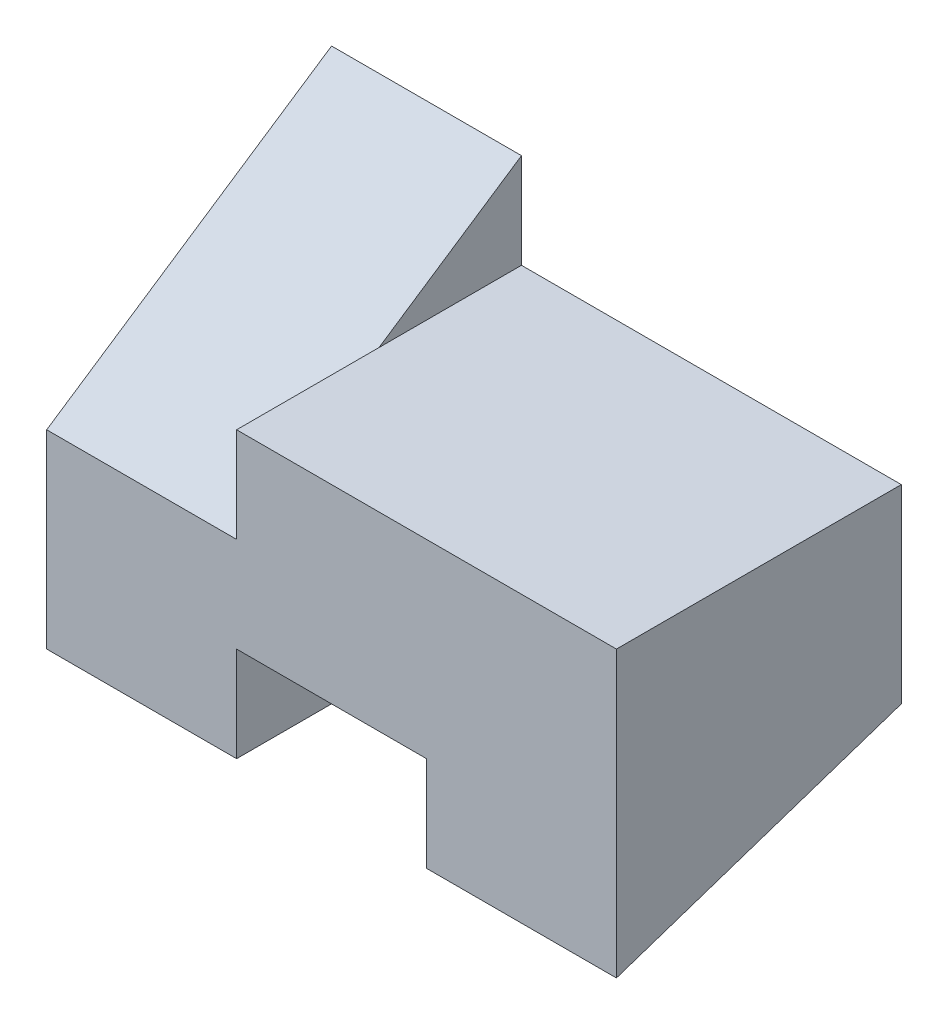
ISO-10303-21;
HEADER;
FILE_DESCRIPTION(('STEP AP214'),'2;1');
FILE_NAME('part.step','',(''),(''),'','','');
FILE_SCHEMA(('AUTOMOTIVE_DESIGN { 1 0 10303 214 1 1 1 1 }'));
ENDSEC;
DATA;
#1=APPLICATION_CONTEXT('core data for automotive mechanical design processes');
#2=APPLICATION_PROTOCOL_DEFINITION('international standard','automotive_design',2000,#1);
#3=PRODUCT_CONTEXT('',#1,'mechanical');
#4=PRODUCT('Part','Part','',(#3));
#5=PRODUCT_RELATED_PRODUCT_CATEGORY('part','',(#4));
#6=PRODUCT_DEFINITION_FORMATION('','',#4);
#7=PRODUCT_DEFINITION_CONTEXT('part definition',#1,'design');
#8=PRODUCT_DEFINITION('design','',#6,#7);
#9=PRODUCT_DEFINITION_SHAPE('','',#8);
#10=(LENGTH_UNIT() NAMED_UNIT(*) SI_UNIT(.MILLI.,.METRE.));
#11=(NAMED_UNIT(*) PLANE_ANGLE_UNIT() SI_UNIT($,.RADIAN.));
#12=(NAMED_UNIT(*) SI_UNIT($,.STERADIAN.) SOLID_ANGLE_UNIT());
#13=UNCERTAINTY_MEASURE_WITH_UNIT(LENGTH_MEASURE(1.E-05),#10,'distance_accuracy_value','');
#14=(GEOMETRIC_REPRESENTATION_CONTEXT(3) GLOBAL_UNCERTAINTY_ASSIGNED_CONTEXT((#13)) GLOBAL_UNIT_ASSIGNED_CONTEXT((#10,
#11,#12)) REPRESENTATION_CONTEXT('',''));
#15=CARTESIAN_POINT('',(0.,0.,0.));
#16=DIRECTION('',(0.,0.,1.));
#17=DIRECTION('',(1.,0.,0.));
#18=AXIS2_PLACEMENT_3D('',#15,#16,#17);
#19=CARTESIAN_POINT('',(-10.,5.,15.));
#20=DIRECTION('',(1.,0.,0.));
#21=DIRECTION('',(0.,1.,0.));
#22=AXIS2_PLACEMENT_3D('',#19,#20,#21);
#23=PLANE('',#22);
#24=DIRECTION('',(0.,0.554700196225229,-0.832050294337844));
#25=VECTOR('',#24,1.);
#26=CARTESIAN_POINT('',(-10.,15.,0.));
#27=LINE('',#26,#25);
#28=CARTESIAN_POINT('',(-10.,5.,15.));
#29=VERTEX_POINT('',#28);
#30=CARTESIAN_POINT('',(-10.,10.,7.5));
#31=VERTEX_POINT('',#30);
#32=EDGE_CURVE('E97',#29,#31,#27,.T.);
#33=ORIENTED_EDGE('',*,*,#32,.F.);
#34=DIRECTION('',(0.,-1.,0.));
#35=VECTOR('',#34,1.);
#36=CARTESIAN_POINT('',(-10.,5.,15.));
#37=LINE('',#36,#35);
#38=CARTESIAN_POINT('',(-10.,10.,15.));
#39=VERTEX_POINT('',#38);
#40=EDGE_CURVE('E99',#39,#29,#37,.T.);
#41=ORIENTED_EDGE('',*,*,#40,.F.);
#42=DIRECTION('',(0.,0.,-1.));
#43=VECTOR('',#42,1.);
#44=CARTESIAN_POINT('',(-10.,10.,15.));
#45=LINE('',#44,#43);
#46=EDGE_CURVE('E100',#39,#31,#45,.T.);
#47=ORIENTED_EDGE('',*,*,#46,.T.);
#48=EDGE_LOOP('',(#33,#41,#47));
#49=FACE_BOUND('',#48,.T.);
#50=ADVANCED_FACE('F33',(#49),#23,.F.);
#51=CARTESIAN_POINT('',(-10.,0.,15.));
#52=DIRECTION('',(-1.,0.,0.));
#53=DIRECTION('',(0.,0.,1.));
#54=AXIS2_PLACEMENT_3D('',#51,#52,#53);
#55=PLANE('',#54);
#56=DIRECTION('',(0.,-0.316227766016838,-0.948683298050514));
#57=VECTOR('',#56,1.);
#58=CARTESIAN_POINT('',(-10.,0.,15.));
#59=LINE('',#58,#57);
#60=CARTESIAN_POINT('',(-10.,0.,15.));
#61=VERTEX_POINT('',#60);
#62=CARTESIAN_POINT('',(-10.,-5.,0.));
#63=VERTEX_POINT('',#62);
#64=EDGE_CURVE('E145',#61,#63,#59,.T.);
#65=ORIENTED_EDGE('',*,*,#64,.F.);
#66=DIRECTION('',(0.,1.,0.));
#67=VECTOR('',#66,1.);
#68=CARTESIAN_POINT('',(-10.,0.,15.));
#69=LINE('',#68,#67);
#70=CARTESIAN_POINT('',(-10.,-5.,15.));
#71=VERTEX_POINT('',#70);
#72=EDGE_CURVE('E82',#71,#61,#69,.T.);
#73=ORIENTED_EDGE('',*,*,#72,.F.);
#74=DIRECTION('',(0.,0.,-1.));
#75=VECTOR('',#74,1.);
#76=CARTESIAN_POINT('',(-10.,-5.,15.));
#77=LINE('',#76,#75);
#78=EDGE_CURVE('E41',#71,#63,#77,.T.);
#79=ORIENTED_EDGE('',*,*,#78,.T.);
#80=EDGE_LOOP('',(#65,#73,#79));
#81=FACE_BOUND('',#80,.T.);
#82=ADVANCED_FACE('F247',(#81),#55,.F.);
#83=CARTESIAN_POINT('',(-10.,-5.,15.));
#84=DIRECTION('',(0.,1.,0.));
#85=DIRECTION('',(0.,0.,1.));
#86=AXIS2_PLACEMENT_3D('',#83,#84,#85);
#87=PLANE('',#86);
#88=DIRECTION('',(1.,0.,0.));
#89=VECTOR('',#88,1.);
#90=CARTESIAN_POINT('',(-10.,-5.,0.));
#91=LINE('',#90,#89);
#92=CARTESIAN_POINT('',(-20.,-5.,0.));
#93=VERTEX_POINT('',#92);
#94=EDGE_CURVE('E123',#93,#63,#91,.T.);
#95=ORIENTED_EDGE('',*,*,#94,.T.);
#96=ORIENTED_EDGE('',*,*,#78,.F.);
#97=DIRECTION('',(1.,0.,0.));
#98=VECTOR('',#97,1.);
#99=CARTESIAN_POINT('',(-10.,-5.,15.));
#100=LINE('',#99,#98);
#101=CARTESIAN_POINT('',(-20.,-5.,15.));
#102=VERTEX_POINT('',#101);
#103=EDGE_CURVE('E130',#102,#71,#100,.T.);
#104=ORIENTED_EDGE('',*,*,#103,.F.);
#105=DIRECTION('',(0.,0.,-1.));
#106=VECTOR('',#105,1.);
#107=CARTESIAN_POINT('',(-20.,-5.,15.));
#108=LINE('',#107,#106);
#109=EDGE_CURVE('E119',#102,#93,#108,.T.);
#110=ORIENTED_EDGE('',*,*,#109,.T.);
#111=EDGE_LOOP('',(#95,#96,#104,#110));
#112=FACE_BOUND('',#111,.T.);
#113=ADVANCED_FACE('F35',(#112),#87,.F.);
#114=CARTESIAN_POINT('',(-10.,10.,15.));
#115=DIRECTION('',(0.,-1.,0.));
#116=DIRECTION('',(1.,0.,0.));
#117=AXIS2_PLACEMENT_3D('',#114,#115,#116);
#118=PLANE('',#117);
#119=DIRECTION('',(-1.,0.,0.));
#120=VECTOR('',#119,1.);
#121=CARTESIAN_POINT('',(-10.,10.,0.));
#122=LINE('',#121,#120);
#123=CARTESIAN_POINT('',(10.,10.,0.));
#124=VERTEX_POINT('',#123);
#125=CARTESIAN_POINT('',(-10.,10.,0.));
#126=VERTEX_POINT('',#125);
#127=EDGE_CURVE('E126',#124,#126,#122,.T.);
#128=ORIENTED_EDGE('',*,*,#127,.T.);
#129=DIRECTION('',(0.,0.,1.));
#130=VECTOR('',#129,1.);
#131=CARTESIAN_POINT('',(-10.,10.,15.));
#132=LINE('',#131,#130);
#133=EDGE_CURVE('E48',#126,#31,#132,.T.);
#134=ORIENTED_EDGE('',*,*,#133,.T.);
#135=ORIENTED_EDGE('',*,*,#46,.F.);
#136=DIRECTION('',(-1.,0.,0.));
#137=VECTOR('',#136,1.);
#138=CARTESIAN_POINT('',(-10.,10.,15.));
#139=LINE('',#138,#137);
#140=CARTESIAN_POINT('',(10.,10.,15.));
#141=VERTEX_POINT('',#140);
#142=EDGE_CURVE('E112',#141,#39,#139,.T.);
#143=ORIENTED_EDGE('',*,*,#142,.F.);
#144=DIRECTION('',(0.,0.,1.));
#145=VECTOR('',#144,1.);
#146=CARTESIAN_POINT('',(10.,10.,15.));
#147=LINE('',#146,#145);
#148=EDGE_CURVE('E160',#124,#141,#147,.T.);
#149=ORIENTED_EDGE('',*,*,#148,.F.);
#150=EDGE_LOOP('',(#128,#134,#135,#143,#149));
#151=FACE_BOUND('',#150,.T.);
#152=ADVANCED_FACE('F235',(#151),#118,.F.);
#153=CARTESIAN_POINT('',(-20.,-5.,15.));
#154=DIRECTION('',(1.,0.,0.));
#155=DIRECTION('',(0.,0.,-1.));
#156=AXIS2_PLACEMENT_3D('',#153,#154,#155);
#157=PLANE('',#156);
#158=DIRECTION('',(0.,-1.,0.));
#159=VECTOR('',#158,1.);
#160=CARTESIAN_POINT('',(-20.,-5.,0.));
#161=LINE('',#160,#159);
#162=CARTESIAN_POINT('',(-20.,15.,0.));
#163=VERTEX_POINT('',#162);
#164=EDGE_CURVE('E74',#163,#93,#161,.T.);
#165=ORIENTED_EDGE('',*,*,#164,.T.);
#166=ORIENTED_EDGE('',*,*,#109,.F.);
#167=DIRECTION('',(0.,-1.,0.));
#168=VECTOR('',#167,1.);
#169=CARTESIAN_POINT('',(-20.,-5.,15.));
#170=LINE('',#169,#168);
#171=CARTESIAN_POINT('',(-20.,5.,15.));
#172=VERTEX_POINT('',#171);
#173=EDGE_CURVE('E57',#172,#102,#170,.T.);
#174=ORIENTED_EDGE('',*,*,#173,.F.);
#175=DIRECTION('',(0.,0.554700196225229,-0.832050294337844));
#176=VECTOR('',#175,1.);
#177=CARTESIAN_POINT('',(-20.,15.,0.));
#178=LINE('',#177,#176);
#179=EDGE_CURVE('E117',#172,#163,#178,.T.);
#180=ORIENTED_EDGE('',*,*,#179,.T.);
#181=EDGE_LOOP('',(#165,#166,#174,#180));
#182=FACE_BOUND('',#181,.T.);
#183=ADVANCED_FACE('F228',(#182),#157,.F.);
#184=CARTESIAN_POINT('',(0.,0.,15.));
#185=DIRECTION('',(0.,0.,-1.));
#186=DIRECTION('',(-1.,0.,0.));
#187=AXIS2_PLACEMENT_3D('',#184,#185,#186);
#188=PLANE('',#187);
#189=ORIENTED_EDGE('',*,*,#103,.T.);
#190=ORIENTED_EDGE('',*,*,#72,.T.);
#191=DIRECTION('',(1.,0.,0.));
#192=VECTOR('',#191,1.);
#193=CARTESIAN_POINT('',(0.,0.,15.));
#194=LINE('',#193,#192);
#195=CARTESIAN_POINT('',(0.,0.,15.));
#196=VERTEX_POINT('',#195);
#197=EDGE_CURVE('E134',#61,#196,#194,.T.);
#198=ORIENTED_EDGE('',*,*,#197,.T.);
#199=DIRECTION('',(0.,-1.,0.));
#200=VECTOR('',#199,1.);
#201=CARTESIAN_POINT('',(0.,-5.,15.));
#202=LINE('',#201,#200);
#203=CARTESIAN_POINT('',(0.,-5.,15.));
#204=VERTEX_POINT('',#203);
#205=EDGE_CURVE('E164',#196,#204,#202,.T.);
#206=ORIENTED_EDGE('',*,*,#205,.T.);
#207=DIRECTION('',(-1.,0.,0.));
#208=VECTOR('',#207,1.);
#209=CARTESIAN_POINT('',(10.,-5.,15.));
#210=LINE('',#209,#208);
#211=CARTESIAN_POINT('',(10.,-5.,15.));
#212=VERTEX_POINT('',#211);
#213=EDGE_CURVE('E153',#212,#204,#210,.T.);
#214=ORIENTED_EDGE('',*,*,#213,.F.);
#215=DIRECTION('',(0.,-1.,0.));
#216=VECTOR('',#215,1.);
#217=CARTESIAN_POINT('',(10.,-5.,15.));
#218=LINE('',#217,#216);
#219=EDGE_CURVE('E179',#141,#212,#218,.T.);
#220=ORIENTED_EDGE('',*,*,#219,.F.);
#221=ORIENTED_EDGE('',*,*,#142,.T.);
#222=ORIENTED_EDGE('',*,*,#40,.T.);
#223=DIRECTION('',(-1.,0.,0.));
#224=VECTOR('',#223,1.);
#225=CARTESIAN_POINT('',(-20.,5.,15.));
#226=LINE('',#225,#224);
#227=EDGE_CURVE('E109',#29,#172,#226,.T.);
#228=ORIENTED_EDGE('',*,*,#227,.T.);
#229=ORIENTED_EDGE('',*,*,#173,.T.);
#230=EDGE_LOOP('',(#189,#190,#198,#206,#214,#220,#221,#222,#228,#229));
#231=FACE_BOUND('',#230,.T.);
#232=ADVANCED_FACE('F108',(#231),#188,.F.);
#233=CARTESIAN_POINT('',(0.,0.,0.));
#234=DIRECTION('',(0.,0.,-1.));
#235=DIRECTION('',(-1.,0.,0.));
#236=AXIS2_PLACEMENT_3D('',#233,#234,#235);
#237=PLANE('',#236);
#238=ORIENTED_EDGE('',*,*,#164,.F.);
#239=DIRECTION('',(1.,0.,0.));
#240=VECTOR('',#239,1.);
#241=CARTESIAN_POINT('',(-20.,15.,0.));
#242=LINE('',#241,#240);
#243=CARTESIAN_POINT('',(-10.,15.,0.));
#244=VERTEX_POINT('',#243);
#245=EDGE_CURVE('E226',#163,#244,#242,.T.);
#246=ORIENTED_EDGE('',*,*,#245,.T.);
#247=DIRECTION('',(0.,-1.,0.));
#248=VECTOR('',#247,1.);
#249=CARTESIAN_POINT('',(-10.,5.,0.));
#250=LINE('',#249,#248);
#251=EDGE_CURVE('E105',#244,#126,#250,.T.);
#252=ORIENTED_EDGE('',*,*,#251,.T.);
#253=ORIENTED_EDGE('',*,*,#127,.F.);
#254=DIRECTION('',(0.,1.,0.));
#255=VECTOR('',#254,1.);
#256=CARTESIAN_POINT('',(10.,-5.,0.));
#257=LINE('',#256,#255);
#258=CARTESIAN_POINT('',(10.,0.,0.));
#259=VERTEX_POINT('',#258);
#260=EDGE_CURVE('E182',#259,#124,#257,.T.);
#261=ORIENTED_EDGE('',*,*,#260,.F.);
#262=DIRECTION('',(1.,0.,0.));
#263=VECTOR('',#262,1.);
#264=CARTESIAN_POINT('',(0.,0.,0.));
#265=LINE('',#264,#263);
#266=CARTESIAN_POINT('',(0.,0.,0.));
#267=VERTEX_POINT('',#266);
#268=EDGE_CURVE('E180',#267,#259,#265,.T.);
#269=ORIENTED_EDGE('',*,*,#268,.F.);
#270=DIRECTION('',(0.,1.,0.));
#271=VECTOR('',#270,1.);
#272=CARTESIAN_POINT('',(0.,-5.,0.));
#273=LINE('',#272,#271);
#274=CARTESIAN_POINT('',(0.,-5.,0.));
#275=VERTEX_POINT('',#274);
#276=EDGE_CURVE('E193',#275,#267,#273,.T.);
#277=ORIENTED_EDGE('',*,*,#276,.F.);
#278=DIRECTION('',(-1.,0.,0.));
#279=VECTOR('',#278,1.);
#280=CARTESIAN_POINT('',(0.,-5.,0.));
#281=LINE('',#280,#279);
#282=EDGE_CURVE('E127',#275,#63,#281,.T.);
#283=ORIENTED_EDGE('',*,*,#282,.T.);
#284=ORIENTED_EDGE('',*,*,#94,.F.);
#285=EDGE_LOOP('',(#238,#246,#252,#253,#261,#269,#277,#283,#284));
#286=FACE_BOUND('',#285,.T.);
#287=ADVANCED_FACE('F224',(#286),#237,.T.);
#288=CARTESIAN_POINT('',(0.,0.,15.));
#289=DIRECTION('',(0.,0.948683298050514,-0.316227766016838));
#290=DIRECTION('',(0.,0.316227766016838,0.948683298050514));
#291=AXIS2_PLACEMENT_3D('',#288,#289,#290);
#292=PLANE('',#291);
#293=ORIENTED_EDGE('',*,*,#64,.T.);
#294=ORIENTED_EDGE('',*,*,#282,.F.);
#295=DIRECTION('',(0.,-0.316227766016838,-0.948683298050514));
#296=VECTOR('',#295,1.);
#297=CARTESIAN_POINT('',(0.,0.,15.));
#298=LINE('',#297,#296);
#299=CARTESIAN_POINT('',(0.,-2.5,7.50000000000001));
#300=VERTEX_POINT('',#299);
#301=EDGE_CURVE('E141',#300,#275,#298,.T.);
#302=ORIENTED_EDGE('',*,*,#301,.F.);
#303=EDGE_CURVE('E138',#196,#300,#298,.T.);
#304=ORIENTED_EDGE('',*,*,#303,.F.);
#305=ORIENTED_EDGE('',*,*,#197,.F.);
#306=EDGE_LOOP('',(#293,#294,#302,#304,#305));
#307=FACE_BOUND('',#306,.T.);
#308=ADVANCED_FACE('F172',(#307),#292,.F.);
#309=CARTESIAN_POINT('',(10.,0.,0.));
#310=DIRECTION('',(-1.,0.,0.));
#311=DIRECTION('',(0.,0.,1.));
#312=AXIS2_PLACEMENT_3D('',#309,#310,#311);
#313=PLANE('',#312);
#314=ORIENTED_EDGE('',*,*,#219,.T.);
#315=DIRECTION('',(0.,-0.316227766016838,0.948683298050514));
#316=VECTOR('',#315,1.);
#317=CARTESIAN_POINT('',(10.,-5.,15.));
#318=LINE('',#317,#316);
#319=EDGE_CURVE('E196',#259,#212,#318,.T.);
#320=ORIENTED_EDGE('',*,*,#319,.F.);
#321=ORIENTED_EDGE('',*,*,#260,.T.);
#322=ORIENTED_EDGE('',*,*,#148,.T.);
#323=EDGE_LOOP('',(#314,#320,#321,#322));
#324=FACE_BOUND('',#323,.T.);
#325=ADVANCED_FACE('F204',(#324),#313,.F.);
#326=CARTESIAN_POINT('',(0.,0.,0.));
#327=DIRECTION('',(-1.,0.,0.));
#328=DIRECTION('',(0.,0.,1.));
#329=AXIS2_PLACEMENT_3D('',#326,#327,#328);
#330=PLANE('',#329);
#331=DIRECTION('',(0.,0.316227766016838,-0.948683298050514));
#332=VECTOR('',#331,1.);
#333=CARTESIAN_POINT('',(0.,0.,0.));
#334=LINE('',#333,#332);
#335=EDGE_CURVE('E11',#204,#300,#334,.T.);
#336=ORIENTED_EDGE('',*,*,#335,.F.);
#337=ORIENTED_EDGE('',*,*,#205,.F.);
#338=ORIENTED_EDGE('',*,*,#303,.T.);
#339=EDGE_LOOP('',(#336,#337,#338));
#340=FACE_BOUND('',#339,.T.);
#341=ADVANCED_FACE('F177',(#340),#330,.T.);
#342=CARTESIAN_POINT('',(0.,0.,0.));
#343=DIRECTION('',(-1.,0.,0.));
#344=DIRECTION('',(0.,0.,1.));
#345=AXIS2_PLACEMENT_3D('',#342,#343,#344);
#346=PLANE('',#345);
#347=ORIENTED_EDGE('',*,*,#276,.T.);
#348=DIRECTION('',(0.,-0.316227766016838,0.948683298050514));
#349=VECTOR('',#348,1.);
#350=CARTESIAN_POINT('',(0.,-5.,15.));
#351=LINE('',#350,#349);
#352=EDGE_CURVE('E185',#267,#300,#351,.T.);
#353=ORIENTED_EDGE('',*,*,#352,.T.);
#354=ORIENTED_EDGE('',*,*,#301,.T.);
#355=EDGE_LOOP('',(#347,#353,#354));
#356=FACE_BOUND('',#355,.T.);
#357=ADVANCED_FACE('F234',(#356),#346,.F.);
#358=CARTESIAN_POINT('',(0.,-5.,15.));
#359=DIRECTION('',(0.,0.948683298050514,0.316227766016838));
#360=DIRECTION('',(0.,-0.316227766016838,0.948683298050514));
#361=AXIS2_PLACEMENT_3D('',#358,#359,#360);
#362=PLANE('',#361);
#363=ORIENTED_EDGE('',*,*,#319,.T.);
#364=ORIENTED_EDGE('',*,*,#213,.T.);
#365=ORIENTED_EDGE('',*,*,#335,.T.);
#366=ORIENTED_EDGE('',*,*,#352,.F.);
#367=ORIENTED_EDGE('',*,*,#268,.T.);
#368=EDGE_LOOP('',(#363,#364,#365,#366,#367));
#369=FACE_BOUND('',#368,.T.);
#370=ADVANCED_FACE('F211',(#369),#362,.F.);
#371=CARTESIAN_POINT('',(-10.,0.,0.));
#372=DIRECTION('',(1.,0.,0.));
#373=DIRECTION('',(0.,1.,0.));
#374=AXIS2_PLACEMENT_3D('',#371,#372,#373);
#375=PLANE('',#374);
#376=ORIENTED_EDGE('',*,*,#133,.F.);
#377=ORIENTED_EDGE('',*,*,#251,.F.);
#378=EDGE_CURVE('E106',#31,#244,#27,.T.);
#379=ORIENTED_EDGE('',*,*,#378,.F.);
#380=EDGE_LOOP('',(#376,#377,#379));
#381=FACE_BOUND('',#380,.T.);
#382=ADVANCED_FACE('F237',(#381),#375,.T.);
#383=CARTESIAN_POINT('',(-20.,15.,0.));
#384=DIRECTION('',(0.,-0.832050294337844,-0.554700196225229));
#385=DIRECTION('',(0.,0.554700196225229,-0.832050294337844));
#386=AXIS2_PLACEMENT_3D('',#383,#384,#385);
#387=PLANE('',#386);
#388=ORIENTED_EDGE('',*,*,#32,.T.);
#389=ORIENTED_EDGE('',*,*,#378,.T.);
#390=ORIENTED_EDGE('',*,*,#245,.F.);
#391=ORIENTED_EDGE('',*,*,#179,.F.);
#392=ORIENTED_EDGE('',*,*,#227,.F.);
#393=EDGE_LOOP('',(#388,#389,#390,#391,#392));
#394=FACE_BOUND('',#393,.T.);
#395=ADVANCED_FACE('F115',(#394),#387,.F.);
#396=CLOSED_SHELL('',(#50,#82,#113,#152,#183,#232,#287,#308,#325,#341,#357,#370,#382,#395));
#397=MANIFOLD_SOLID_BREP('B2',#396);
#398=ADVANCED_BREP_SHAPE_REPRESENTATION('',(#18,#397),#14);
#399=SHAPE_DEFINITION_REPRESENTATION(#9,#398);
ENDSEC;
END-ISO-10303-21;
